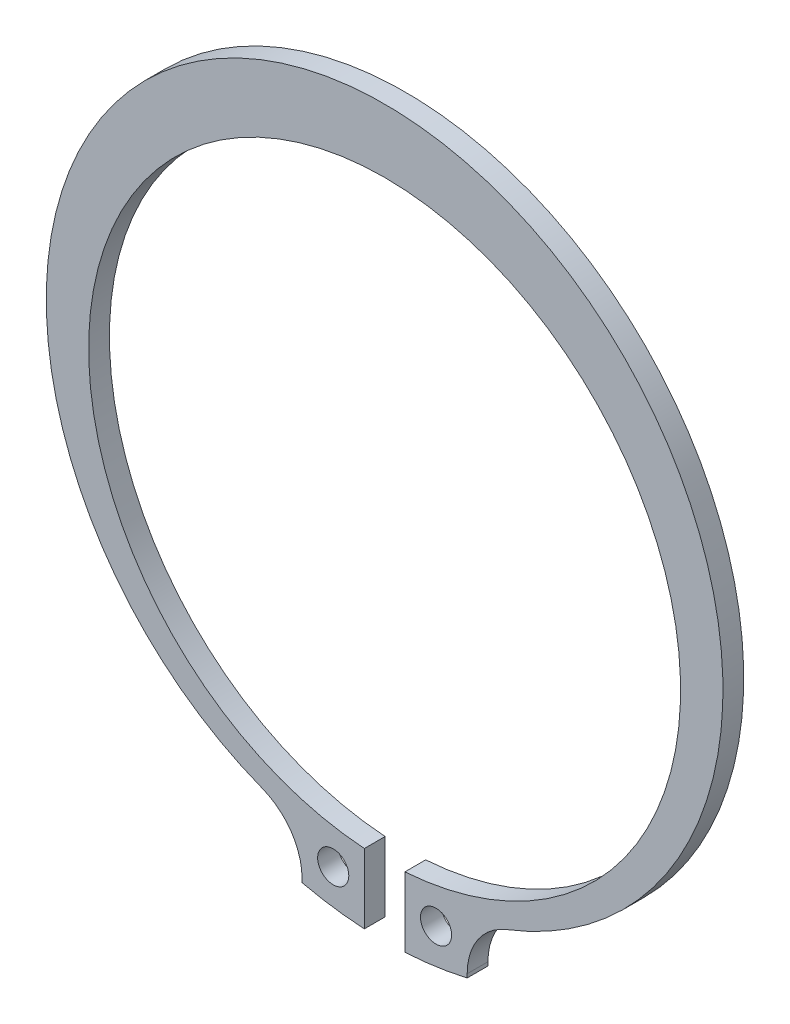
ISO-10303-21;
HEADER;
FILE_DESCRIPTION(('STEP AP214'),'2;1');
FILE_NAME('part.step','',(''),(''),'','','');
FILE_SCHEMA(('AUTOMOTIVE_DESIGN { 1 0 10303 214 1 1 1 1 }'));
ENDSEC;
DATA;
#1=APPLICATION_CONTEXT('core data for automotive mechanical design processes');
#2=APPLICATION_PROTOCOL_DEFINITION('international standard','automotive_design',2000,#1);
#3=PRODUCT_CONTEXT('',#1,'mechanical');
#4=PRODUCT('Part','Part','',(#3));
#5=PRODUCT_RELATED_PRODUCT_CATEGORY('part','',(#4));
#6=PRODUCT_DEFINITION_FORMATION('','',#4);
#7=PRODUCT_DEFINITION_CONTEXT('part definition',#1,'design');
#8=PRODUCT_DEFINITION('design','',#6,#7);
#9=PRODUCT_DEFINITION_SHAPE('','',#8);
#10=(LENGTH_UNIT() NAMED_UNIT(*) SI_UNIT(.MILLI.,.METRE.));
#11=(NAMED_UNIT(*) PLANE_ANGLE_UNIT() SI_UNIT($,.RADIAN.));
#12=(NAMED_UNIT(*) SI_UNIT($,.STERADIAN.) SOLID_ANGLE_UNIT());
#13=UNCERTAINTY_MEASURE_WITH_UNIT(LENGTH_MEASURE(1.E-05),#10,'distance_accuracy_value','');
#14=(GEOMETRIC_REPRESENTATION_CONTEXT(3) GLOBAL_UNCERTAINTY_ASSIGNED_CONTEXT((#13)) GLOBAL_UNIT_ASSIGNED_CONTEXT((#10,
#11,#12)) REPRESENTATION_CONTEXT('',''));
#15=CARTESIAN_POINT('',(0.,0.,0.));
#16=DIRECTION('',(0.,0.,1.));
#17=DIRECTION('',(1.,0.,0.));
#18=AXIS2_PLACEMENT_3D('',#15,#16,#17);
#19=CARTESIAN_POINT('',(9.9,-5.85070601971,0.));
#20=DIRECTION('',(1.,0.,0.));
#21=DIRECTION('',(0.,0.,-1.));
#22=AXIS2_PLACEMENT_3D('',#19,#20,#21);
#23=PLANE('',#22);
#24=DIRECTION('',(0.,0.,1.));
#25=VECTOR('',#24,1.);
#26=CARTESIAN_POINT('',(9.89999999998941,-5.8507060196643,0.));
#27=LINE('',#26,#25);
#28=CARTESIAN_POINT('',(9.89999999999471,-5.85070601966307,0.));
#29=VERTEX_POINT('',#28);
#30=CARTESIAN_POINT('',(9.89999999999471,-5.85070601966307,2.));
#31=VERTEX_POINT('',#30);
#32=EDGE_CURVE('E95',#29,#31,#27,.T.);
#33=ORIENTED_EDGE('',*,*,#32,.F.);
#34=DIRECTION('',(0.,1.,0.));
#35=VECTOR('',#34,1.);
#36=CARTESIAN_POINT('',(9.9,0.,0.));
#37=LINE('',#36,#35);
#38=CARTESIAN_POINT('',(9.9,-5.49641347023,0.));
#39=VERTEX_POINT('',#38);
#40=EDGE_CURVE('E98',#29,#39,#37,.T.);
#41=ORIENTED_EDGE('',*,*,#40,.T.);
#42=DIRECTION('',(0.,0.,1.));
#43=VECTOR('',#42,1.);
#44=CARTESIAN_POINT('',(9.9,-5.49641347023,0.));
#45=LINE('',#44,#43);
#46=CARTESIAN_POINT('',(9.9,-5.49641347023,2.));
#47=VERTEX_POINT('',#46);
#48=EDGE_CURVE('E118',#39,#47,#45,.T.);
#49=ORIENTED_EDGE('',*,*,#48,.T.);
#50=DIRECTION('',(0.,1.,0.));
#51=VECTOR('',#50,1.);
#52=CARTESIAN_POINT('',(9.9,-5.85070601971,2.));
#53=LINE('',#52,#51);
#54=EDGE_CURVE('E100',#47,#31,#53,.F.);
#55=ORIENTED_EDGE('',*,*,#54,.T.);
#56=EDGE_LOOP('',(#33,#41,#49,#55));
#57=FACE_BOUND('',#56,.T.);
#58=ADVANCED_FACE('F16',(#57),#23,.T.);
#59=CARTESIAN_POINT('',(-6.,-5.49641347023,0.));
#60=DIRECTION('',(-1.,0.,0.));
#61=DIRECTION('',(0.,0.,1.));
#62=AXIS2_PLACEMENT_3D('',#59,#60,#61);
#63=PLANE('',#62);
#64=DIRECTION('',(0.,0.,1.));
#65=VECTOR('',#64,1.);
#66=CARTESIAN_POINT('',(-6.,-5.49641347023,0.));
#67=LINE('',#66,#65);
#68=CARTESIAN_POINT('',(-6.,-5.49641347023,2.));
#69=VERTEX_POINT('',#68);
#70=CARTESIAN_POINT('',(-6.,-5.49641347023,0.));
#71=VERTEX_POINT('',#70);
#72=EDGE_CURVE('E174',#69,#71,#67,.F.);
#73=ORIENTED_EDGE('',*,*,#72,.T.);
#74=DIRECTION('',(0.,1.,0.));
#75=VECTOR('',#74,1.);
#76=CARTESIAN_POINT('',(-6.,0.,0.));
#77=LINE('',#76,#75);
#78=CARTESIAN_POINT('',(-5.99999999999471,-5.85070601966307,0.));
#79=VERTEX_POINT('',#78);
#80=EDGE_CURVE('E114',#71,#79,#77,.F.);
#81=ORIENTED_EDGE('',*,*,#80,.T.);
#82=DIRECTION('',(0.,0.,1.));
#83=VECTOR('',#82,1.);
#84=CARTESIAN_POINT('',(-5.99999999998942,-5.85070601966429,0.));
#85=LINE('',#84,#83);
#86=CARTESIAN_POINT('',(-5.99999999999471,-5.85070601966307,2.));
#87=VERTEX_POINT('',#86);
#88=EDGE_CURVE('E161',#87,#79,#85,.F.);
#89=ORIENTED_EDGE('',*,*,#88,.F.);
#90=DIRECTION('',(0.,1.,0.));
#91=VECTOR('',#90,1.);
#92=CARTESIAN_POINT('',(-6.,-5.49641347023,2.));
#93=LINE('',#92,#91);
#94=EDGE_CURVE('E115',#87,#69,#93,.T.);
#95=ORIENTED_EDGE('',*,*,#94,.T.);
#96=EDGE_LOOP('',(#73,#81,#89,#95));
#97=FACE_BOUND('',#96,.T.);
#98=ADVANCED_FACE('F210',(#97),#63,.T.);
#99=CARTESIAN_POINT('',(0.,0.,0.));
#100=DIRECTION('',(0.,0.,1.));
#101=DIRECTION('',(1.,0.,0.));
#102=AXIS2_PLACEMENT_3D('',#99,#100,#101);
#103=PLANE('',#102);
#104=CARTESIAN_POINT('',(6.9,-3.02654355576,0.));
#105=DIRECTION('',(0.,0.,-1.));
#106=DIRECTION('',(-1.,0.,0.));
#107=AXIS2_PLACEMENT_3D('',#104,#105,#106);
#108=CIRCLE('',#107,1.5);
#109=CARTESIAN_POINT('',(5.4,-3.02654355576,0.));
#110=VERTEX_POINT('',#109);
#111=EDGE_CURVE('E151',#110,#110,#108,.F.);
#112=ORIENTED_EDGE('',*,*,#111,.T.);
#113=EDGE_LOOP('',(#112));
#114=FACE_BOUND('',#113,.T.);
#115=CARTESIAN_POINT('',(-3.,-3.02654355576,0.));
#116=DIRECTION('',(0.,0.,1.));
#117=DIRECTION('',(1.,0.,0.));
#118=AXIS2_PLACEMENT_3D('',#115,#116,#117);
#119=CIRCLE('',#118,1.5);
#120=CARTESIAN_POINT('',(-1.5,-3.02654355576,0.));
#121=VERTEX_POINT('',#120);
#122=EDGE_CURVE('E154',#121,#121,#119,.T.);
#123=ORIENTED_EDGE('',*,*,#122,.T.);
#124=EDGE_LOOP('',(#123));
#125=FACE_BOUND('',#124,.T.);
#126=CARTESIAN_POINT('',(1.95,28.4332112151,0.));
#127=DIRECTION('',(0.,0.,1.));
#128=DIRECTION('',(1.,0.,0.));
#129=AXIS2_PLACEMENT_3D('',#126,#127,#128);
#130=CIRCLE('',#129,35.1936);
#131=CARTESIAN_POINT('',(0.,-6.7063246520891,0.));
#132=VERTEX_POINT('',#131);
#133=EDGE_CURVE('E159',#79,#132,#130,.T.);
#134=ORIENTED_EDGE('',*,*,#133,.F.);
#135=ORIENTED_EDGE('',*,*,#80,.F.);
#136=CARTESIAN_POINT('',(-12.,-5.49641347023,0.));
#137=DIRECTION('',(0.,0.,1.));
#138=DIRECTION('',(1.,0.,0.));
#139=AXIS2_PLACEMENT_3D('',#136,#137,#138);
#140=CIRCLE('',#139,6.);
#141=CARTESIAN_POINT('',(-9.83048211508956,0.0976183626302442,0.));
#142=VERTEX_POINT('',#141);
#143=EDGE_CURVE('E162',#71,#142,#140,.T.);
#144=ORIENTED_EDGE('',*,*,#143,.T.);
#145=CARTESIAN_POINT('',(1.95,30.4732112151,0.));
#146=DIRECTION('',(0.,0.,1.));
#147=DIRECTION('',(1.,0.,0.));
#148=AXIS2_PLACEMENT_3D('',#145,#146,#147);
#149=CIRCLE('',#148,32.58);
#150=CARTESIAN_POINT('',(13.7304821150857,0.0976183626530914,0.));
#151=VERTEX_POINT('',#150);
#152=EDGE_CURVE('E165',#151,#142,#149,.T.);
#153=ORIENTED_EDGE('',*,*,#152,.F.);
#154=CARTESIAN_POINT('',(15.9,-5.49641347023,0.));
#155=DIRECTION('',(0.,0.,1.));
#156=DIRECTION('',(1.,0.,0.));
#157=AXIS2_PLACEMENT_3D('',#154,#155,#156);
#158=CIRCLE('',#157,6.);
#159=EDGE_CURVE('E112',#151,#39,#158,.T.);
#160=ORIENTED_EDGE('',*,*,#159,.T.);
#161=ORIENTED_EDGE('',*,*,#40,.F.);
#162=CARTESIAN_POINT('',(1.95,28.4332112151,0.));
#163=DIRECTION('',(0.,0.,1.));
#164=DIRECTION('',(1.,0.,0.));
#165=AXIS2_PLACEMENT_3D('',#162,#163,#164);
#166=CIRCLE('',#165,35.1936);
#167=CARTESIAN_POINT('',(3.89999999999884,-6.70632465206826,0.));
#168=VERTEX_POINT('',#167);
#169=EDGE_CURVE('E19',#168,#29,#166,.T.);
#170=ORIENTED_EDGE('',*,*,#169,.F.);
#171=DIRECTION('',(0.,1.,0.));
#172=VECTOR('',#171,1.);
#173=CARTESIAN_POINT('',(3.9,0.,0.));
#174=LINE('',#173,#172);
#175=CARTESIAN_POINT('',(3.8999999999985,4.36543162729564E-11,0.));
#176=VERTEX_POINT('',#175);
#177=EDGE_CURVE('E90',#176,#168,#174,.F.);
#178=ORIENTED_EDGE('',*,*,#177,.F.);
#179=CARTESIAN_POINT('',(1.95,28.4332112151,0.));
#180=DIRECTION('',(0.,0.,1.));
#181=DIRECTION('',(1.,0.,0.));
#182=AXIS2_PLACEMENT_3D('',#179,#180,#181);
#183=CIRCLE('',#182,28.5);
#184=CARTESIAN_POINT('',(1.49294639151254E-12,4.36543162729564E-11,0.));
#185=VERTEX_POINT('',#184);
#186=EDGE_CURVE('E126',#176,#185,#183,.T.);
#187=ORIENTED_EDGE('',*,*,#186,.T.);
#188=DIRECTION('',(0.,1.,0.));
#189=VECTOR('',#188,1.);
#190=CARTESIAN_POINT('',(0.,-6.70632465211,0.));
#191=LINE('',#190,#189);
#192=EDGE_CURVE('E124',#132,#185,#191,.T.);
#193=ORIENTED_EDGE('',*,*,#192,.F.);
#194=EDGE_LOOP('',(#134,#135,#144,#153,#160,#161,#170,#178,#187,#193));
#195=FACE_BOUND('',#194,.T.);
#196=ADVANCED_FACE('F109',(#114,#125,#195),#103,.F.);
#197=CARTESIAN_POINT('',(3.9,0.,0.));
#198=DIRECTION('',(-1.,0.,0.));
#199=DIRECTION('',(0.,0.,1.));
#200=AXIS2_PLACEMENT_3D('',#197,#198,#199);
#201=PLANE('',#200);
#202=DIRECTION('',(0.,0.,1.));
#203=VECTOR('',#202,1.);
#204=CARTESIAN_POINT('',(3.899999999997,4.35519675878737E-11,0.));
#205=LINE('',#204,#203);
#206=CARTESIAN_POINT('',(3.8999999999985,4.36543162729564E-11,2.));
#207=VERTEX_POINT('',#206);
#208=EDGE_CURVE('E157',#207,#176,#205,.F.);
#209=ORIENTED_EDGE('',*,*,#208,.T.);
#210=ORIENTED_EDGE('',*,*,#177,.T.);
#211=DIRECTION('',(0.,0.,1.));
#212=VECTOR('',#211,1.);
#213=CARTESIAN_POINT('',(3.89999999999767,-6.70632465206833,0.));
#214=LINE('',#213,#212);
#215=CARTESIAN_POINT('',(3.89999999999884,-6.70632465206826,2.));
#216=VERTEX_POINT('',#215);
#217=EDGE_CURVE('E105',#216,#168,#214,.F.);
#218=ORIENTED_EDGE('',*,*,#217,.F.);
#219=DIRECTION('',(0.,1.,0.));
#220=VECTOR('',#219,1.);
#221=CARTESIAN_POINT('',(3.9,0.,2.));
#222=LINE('',#221,#220);
#223=EDGE_CURVE('E150',#207,#216,#222,.F.);
#224=ORIENTED_EDGE('',*,*,#223,.F.);
#225=EDGE_LOOP('',(#209,#210,#218,#224));
#226=FACE_BOUND('',#225,.T.);
#227=ADVANCED_FACE('F199',(#226),#201,.T.);
#228=CARTESIAN_POINT('',(1.95,28.4332112151,0.));
#229=DIRECTION('',(0.,0.,1.));
#230=DIRECTION('',(1.,0.,0.));
#231=AXIS2_PLACEMENT_3D('',#228,#229,#230);
#232=CYLINDRICAL_SURFACE('',#231,35.1936);
#233=ORIENTED_EDGE('',*,*,#217,.T.);
#234=ORIENTED_EDGE('',*,*,#169,.T.);
#235=ORIENTED_EDGE('',*,*,#32,.T.);
#236=CARTESIAN_POINT('',(1.95,28.4332112151,2.));
#237=DIRECTION('',(0.,0.,1.));
#238=DIRECTION('',(1.,0.,0.));
#239=AXIS2_PLACEMENT_3D('',#236,#237,#238);
#240=CIRCLE('',#239,35.1936);
#241=EDGE_CURVE('E148',#216,#31,#240,.T.);
#242=ORIENTED_EDGE('',*,*,#241,.F.);
#243=EDGE_LOOP('',(#233,#234,#235,#242));
#244=FACE_BOUND('',#243,.T.);
#245=ADVANCED_FACE('F117',(#244),#232,.T.);
#246=CARTESIAN_POINT('',(15.9,-5.49641347023,0.));
#247=DIRECTION('',(0.,0.,1.));
#248=DIRECTION('',(1.,0.,0.));
#249=AXIS2_PLACEMENT_3D('',#246,#247,#248);
#250=CYLINDRICAL_SURFACE('',#249,6.);
#251=CARTESIAN_POINT('',(15.9,-5.49641347023,2.));
#252=DIRECTION('',(0.,0.,1.));
#253=DIRECTION('',(1.,0.,0.));
#254=AXIS2_PLACEMENT_3D('',#251,#252,#253);
#255=CIRCLE('',#254,6.);
#256=CARTESIAN_POINT('',(13.7304821150775,0.0976183626742455,2.));
#257=VERTEX_POINT('',#256);
#258=EDGE_CURVE('E145',#47,#257,#255,.F.);
#259=ORIENTED_EDGE('',*,*,#258,.F.);
#260=ORIENTED_EDGE('',*,*,#48,.F.);
#261=ORIENTED_EDGE('',*,*,#159,.F.);
#262=DIRECTION('',(0.,0.,1.));
#263=VECTOR('',#262,1.);
#264=CARTESIAN_POINT('',(13.7304821150834,0.0976183626765111,0.));
#265=LINE('',#264,#263);
#266=EDGE_CURVE('E167',#257,#151,#265,.F.);
#267=ORIENTED_EDGE('',*,*,#266,.F.);
#268=EDGE_LOOP('',(#259,#260,#261,#267));
#269=FACE_BOUND('',#268,.T.);
#270=ADVANCED_FACE('F202',(#269),#250,.F.);
#271=CARTESIAN_POINT('',(1.95,30.4732112151,0.));
#272=DIRECTION('',(0.,0.,1.));
#273=DIRECTION('',(1.,0.,0.));
#274=AXIS2_PLACEMENT_3D('',#271,#272,#273);
#275=CYLINDRICAL_SURFACE('',#274,32.58);
#276=ORIENTED_EDGE('',*,*,#266,.T.);
#277=ORIENTED_EDGE('',*,*,#152,.T.);
#278=DIRECTION('',(0.,0.,1.));
#279=VECTOR('',#278,1.);
#280=CARTESIAN_POINT('',(-9.83048211509104,0.0976183626308167,0.));
#281=LINE('',#280,#279);
#282=CARTESIAN_POINT('',(-9.83048211508956,0.0976183626302442,2.));
#283=VERTEX_POINT('',#282);
#284=EDGE_CURVE('E164',#142,#283,#281,.T.);
#285=ORIENTED_EDGE('',*,*,#284,.T.);
#286=CARTESIAN_POINT('',(1.95,30.4732112151,2.));
#287=DIRECTION('',(0.,0.,1.));
#288=DIRECTION('',(1.,0.,0.));
#289=AXIS2_PLACEMENT_3D('',#286,#287,#288);
#290=CIRCLE('',#289,32.58);
#291=EDGE_CURVE('E142',#257,#283,#290,.T.);
#292=ORIENTED_EDGE('',*,*,#291,.F.);
#293=EDGE_LOOP('',(#276,#277,#285,#292));
#294=FACE_BOUND('',#293,.T.);
#295=ADVANCED_FACE('F203',(#294),#275,.T.);
#296=CARTESIAN_POINT('',(-12.,-5.49641347023,0.));
#297=DIRECTION('',(0.,0.,1.));
#298=DIRECTION('',(1.,0.,0.));
#299=AXIS2_PLACEMENT_3D('',#296,#297,#298);
#300=CYLINDRICAL_SURFACE('',#299,6.);
#301=CARTESIAN_POINT('',(-12.,-5.49641347023,2.));
#302=DIRECTION('',(0.,0.,1.));
#303=DIRECTION('',(1.,0.,0.));
#304=AXIS2_PLACEMENT_3D('',#301,#302,#303);
#305=CIRCLE('',#304,6.);
#306=EDGE_CURVE('E139',#283,#69,#305,.F.);
#307=ORIENTED_EDGE('',*,*,#306,.F.);
#308=ORIENTED_EDGE('',*,*,#284,.F.);
#309=ORIENTED_EDGE('',*,*,#143,.F.);
#310=ORIENTED_EDGE('',*,*,#72,.F.);
#311=EDGE_LOOP('',(#307,#308,#309,#310));
#312=FACE_BOUND('',#311,.T.);
#313=ADVANCED_FACE('F207',(#312),#300,.F.);
#314=CARTESIAN_POINT('',(1.95,28.4332112151,0.));
#315=DIRECTION('',(0.,0.,1.));
#316=DIRECTION('',(1.,0.,0.));
#317=AXIS2_PLACEMENT_3D('',#314,#315,#316);
#318=CYLINDRICAL_SURFACE('',#317,35.1936);
#319=ORIENTED_EDGE('',*,*,#88,.T.);
#320=ORIENTED_EDGE('',*,*,#133,.T.);
#321=DIRECTION('',(0.,0.,-1.));
#322=VECTOR('',#321,1.);
#323=CARTESIAN_POINT('',(0.,-6.70632465211,0.));
#324=LINE('',#323,#322);
#325=CARTESIAN_POINT('',(0.,-6.7063246520891,2.));
#326=VERTEX_POINT('',#325);
#327=EDGE_CURVE('E127',#326,#132,#324,.T.);
#328=ORIENTED_EDGE('',*,*,#327,.F.);
#329=CARTESIAN_POINT('',(1.95,28.4332112151,2.));
#330=DIRECTION('',(0.,0.,1.));
#331=DIRECTION('',(1.,0.,0.));
#332=AXIS2_PLACEMENT_3D('',#329,#330,#331);
#333=CIRCLE('',#332,35.1936);
#334=EDGE_CURVE('E136',#87,#326,#333,.T.);
#335=ORIENTED_EDGE('',*,*,#334,.F.);
#336=EDGE_LOOP('',(#319,#320,#328,#335));
#337=FACE_BOUND('',#336,.T.);
#338=ADVANCED_FACE('F193',(#337),#318,.T.);
#339=CARTESIAN_POINT('',(0.,-6.70632465211,0.));
#340=DIRECTION('',(1.,0.,0.));
#341=DIRECTION('',(0.,0.,-1.));
#342=AXIS2_PLACEMENT_3D('',#339,#340,#341);
#343=PLANE('',#342);
#344=ORIENTED_EDGE('',*,*,#327,.T.);
#345=ORIENTED_EDGE('',*,*,#192,.T.);
#346=DIRECTION('',(0.,0.,1.));
#347=VECTOR('',#346,1.);
#348=CARTESIAN_POINT('',(2.98589278302508E-12,4.35519675878737E-11,0.));
#349=LINE('',#348,#347);
#350=CARTESIAN_POINT('',(1.49294639151254E-12,4.36543162729564E-11,2.));
#351=VERTEX_POINT('',#350);
#352=EDGE_CURVE('E34',#185,#351,#349,.T.);
#353=ORIENTED_EDGE('',*,*,#352,.T.);
#354=DIRECTION('',(0.,1.,0.));
#355=VECTOR('',#354,1.);
#356=CARTESIAN_POINT('',(0.,0.,2.));
#357=LINE('',#356,#355);
#358=EDGE_CURVE('E135',#326,#351,#357,.T.);
#359=ORIENTED_EDGE('',*,*,#358,.F.);
#360=EDGE_LOOP('',(#344,#345,#353,#359));
#361=FACE_BOUND('',#360,.T.);
#362=ADVANCED_FACE('F190',(#361),#343,.T.);
#363=CARTESIAN_POINT('',(1.95,28.4332112151,0.));
#364=DIRECTION('',(0.,0.,1.));
#365=DIRECTION('',(1.,0.,0.));
#366=AXIS2_PLACEMENT_3D('',#363,#364,#365);
#367=CYLINDRICAL_SURFACE('',#366,28.5);
#368=CARTESIAN_POINT('',(1.95,28.4332112151,2.));
#369=DIRECTION('',(0.,0.,1.));
#370=DIRECTION('',(1.,0.,0.));
#371=AXIS2_PLACEMENT_3D('',#368,#369,#370);
#372=CIRCLE('',#371,28.5);
#373=EDGE_CURVE('E132',#351,#207,#372,.F.);
#374=ORIENTED_EDGE('',*,*,#373,.F.);
#375=ORIENTED_EDGE('',*,*,#352,.F.);
#376=ORIENTED_EDGE('',*,*,#186,.F.);
#377=ORIENTED_EDGE('',*,*,#208,.F.);
#378=EDGE_LOOP('',(#374,#375,#376,#377));
#379=FACE_BOUND('',#378,.T.);
#380=ADVANCED_FACE('F198',(#379),#367,.F.);
#381=CARTESIAN_POINT('',(-3.,-3.02654355576,2.));
#382=DIRECTION('',(0.,0.,1.));
#383=DIRECTION('',(1.,0.,0.));
#384=AXIS2_PLACEMENT_3D('',#381,#382,#383);
#385=CYLINDRICAL_SURFACE('',#384,1.5);
#386=CARTESIAN_POINT('',(-3.,-3.02654355576,2.));
#387=DIRECTION('',(0.,0.,1.));
#388=DIRECTION('',(1.,0.,0.));
#389=AXIS2_PLACEMENT_3D('',#386,#387,#388);
#390=CIRCLE('',#389,1.5);
#391=CARTESIAN_POINT('',(-1.5,-3.02654355576,2.));
#392=VERTEX_POINT('',#391);
#393=EDGE_CURVE('E25',#392,#392,#390,.F.);
#394=ORIENTED_EDGE('',*,*,#393,.F.);
#395=EDGE_LOOP('',(#394));
#396=FACE_BOUND('',#395,.T.);
#397=ORIENTED_EDGE('',*,*,#122,.F.);
#398=EDGE_LOOP('',(#397));
#399=FACE_BOUND('',#398,.T.);
#400=ADVANCED_FACE('F226',(#396,#399),#385,.F.);
#401=CARTESIAN_POINT('',(6.9,-3.02654355576,2.));
#402=DIRECTION('',(0.,0.,-1.));
#403=DIRECTION('',(-1.,0.,0.));
#404=AXIS2_PLACEMENT_3D('',#401,#402,#403);
#405=CYLINDRICAL_SURFACE('',#404,1.5);
#406=CARTESIAN_POINT('',(6.9,-3.02654355576,2.));
#407=DIRECTION('',(0.,0.,-1.));
#408=DIRECTION('',(-1.,0.,0.));
#409=AXIS2_PLACEMENT_3D('',#406,#407,#408);
#410=CIRCLE('',#409,1.5);
#411=CARTESIAN_POINT('',(5.4,-3.02654355576,2.));
#412=VERTEX_POINT('',#411);
#413=EDGE_CURVE('E11',#412,#412,#410,.T.);
#414=ORIENTED_EDGE('',*,*,#413,.F.);
#415=EDGE_LOOP('',(#414));
#416=FACE_BOUND('',#415,.T.);
#417=ORIENTED_EDGE('',*,*,#111,.F.);
#418=EDGE_LOOP('',(#417));
#419=FACE_BOUND('',#418,.T.);
#420=ADVANCED_FACE('F220',(#416,#419),#405,.F.);
#421=CARTESIAN_POINT('',(0.,0.,2.));
#422=DIRECTION('',(0.,0.,1.));
#423=DIRECTION('',(1.,0.,0.));
#424=AXIS2_PLACEMENT_3D('',#421,#422,#423);
#425=PLANE('',#424);
#426=ORIENTED_EDGE('',*,*,#413,.T.);
#427=EDGE_LOOP('',(#426));
#428=FACE_BOUND('',#427,.T.);
#429=ORIENTED_EDGE('',*,*,#393,.T.);
#430=EDGE_LOOP('',(#429));
#431=FACE_BOUND('',#430,.T.);
#432=ORIENTED_EDGE('',*,*,#358,.T.);
#433=ORIENTED_EDGE('',*,*,#373,.T.);
#434=ORIENTED_EDGE('',*,*,#223,.T.);
#435=ORIENTED_EDGE('',*,*,#241,.T.);
#436=ORIENTED_EDGE('',*,*,#54,.F.);
#437=ORIENTED_EDGE('',*,*,#258,.T.);
#438=ORIENTED_EDGE('',*,*,#291,.T.);
#439=ORIENTED_EDGE('',*,*,#306,.T.);
#440=ORIENTED_EDGE('',*,*,#94,.F.);
#441=ORIENTED_EDGE('',*,*,#334,.T.);
#442=EDGE_LOOP('',(#432,#433,#434,#435,#436,#437,#438,#439,#440,#441));
#443=FACE_BOUND('',#442,.T.);
#444=ADVANCED_FACE('F188',(#428,#431,#443),#425,.T.);
#445=CLOSED_SHELL('',(#58,#98,#196,#227,#245,#270,#295,#313,#338,#362,#380,#400,#420,#444));
#446=MANIFOLD_SOLID_BREP('B1',#445);
#447=ADVANCED_BREP_SHAPE_REPRESENTATION('',(#18,#446),#14);
#448=SHAPE_DEFINITION_REPRESENTATION(#9,#447);
ENDSEC;
END-ISO-10303-21;
